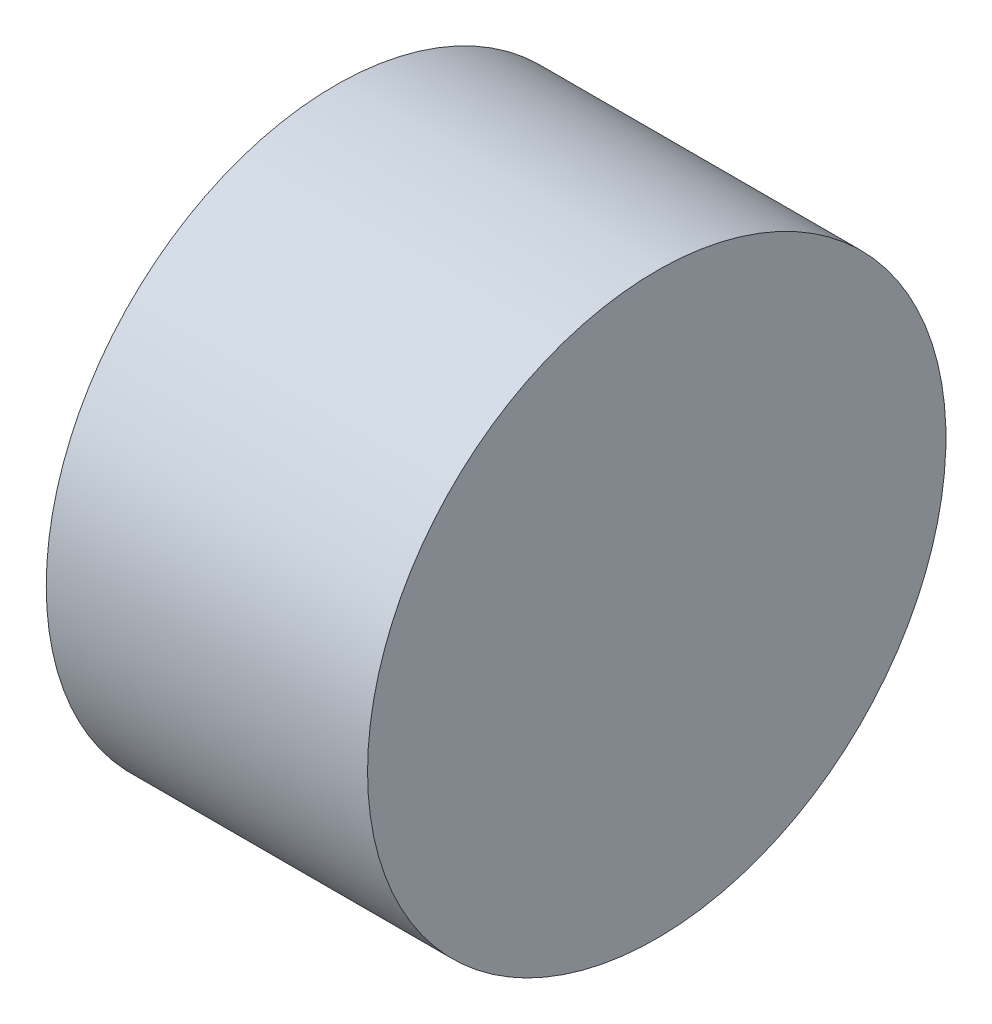
ISO-10303-21;
HEADER;
FILE_DESCRIPTION(('STEP AP214'),'2;1');
FILE_NAME('part.step','',(''),(''),'','','');
FILE_SCHEMA(('AUTOMOTIVE_DESIGN { 1 0 10303 214 1 1 1 1 }'));
ENDSEC;
DATA;
#1=APPLICATION_CONTEXT('core data for automotive mechanical design processes');
#2=APPLICATION_PROTOCOL_DEFINITION('international standard','automotive_design',2000,#1);
#3=PRODUCT_CONTEXT('',#1,'mechanical');
#4=PRODUCT('Part','Part','',(#3));
#5=PRODUCT_RELATED_PRODUCT_CATEGORY('part','',(#4));
#6=PRODUCT_DEFINITION_FORMATION('','',#4);
#7=PRODUCT_DEFINITION_CONTEXT('part definition',#1,'design');
#8=PRODUCT_DEFINITION('design','',#6,#7);
#9=PRODUCT_DEFINITION_SHAPE('','',#8);
#10=(LENGTH_UNIT() NAMED_UNIT(*) SI_UNIT(.MILLI.,.METRE.));
#11=(NAMED_UNIT(*) PLANE_ANGLE_UNIT() SI_UNIT($,.RADIAN.));
#12=(NAMED_UNIT(*) SI_UNIT($,.STERADIAN.) SOLID_ANGLE_UNIT());
#13=UNCERTAINTY_MEASURE_WITH_UNIT(LENGTH_MEASURE(1.E-05),#10,'distance_accuracy_value','');
#14=(GEOMETRIC_REPRESENTATION_CONTEXT(3) GLOBAL_UNCERTAINTY_ASSIGNED_CONTEXT((#13)) GLOBAL_UNIT_ASSIGNED_CONTEXT((#10,
#11,#12)) REPRESENTATION_CONTEXT('',''));
#15=CARTESIAN_POINT('',(0.,0.,0.));
#16=DIRECTION('',(0.,0.,1.));
#17=DIRECTION('',(1.,0.,0.));
#18=AXIS2_PLACEMENT_3D('',#15,#16,#17);
#19=CARTESIAN_POINT('',(-3.433333333333,-3.6,15.424059202831));
#20=DIRECTION('',(-1.,0.,0.));
#21=DIRECTION('',(0.,0.,1.));
#22=AXIS2_PLACEMENT_3D('',#19,#20,#21);
#23=PLANE('',#22);
#24=CARTESIAN_POINT('',(-3.433333333333,-3.6,15.424059202831));
#25=DIRECTION('',(-1.,0.,0.));
#26=DIRECTION('',(0.,0.,1.));
#27=AXIS2_PLACEMENT_3D('',#24,#25,#26);
#28=CIRCLE('',#27,0.3);
#29=CARTESIAN_POINT('',(-3.433333333333,-3.6,15.724059202831));
#30=VERTEX_POINT('',#29);
#31=EDGE_CURVE('E18',#30,#30,#28,.T.);
#32=ORIENTED_EDGE('',*,*,#31,.F.);
#33=EDGE_LOOP('',(#32));
#34=FACE_BOUND('',#33,.T.);
#35=ADVANCED_FACE('F15',(#34),#23,.F.);
#36=CARTESIAN_POINT('',(-3.766666666667,-3.6,15.424059202831));
#37=DIRECTION('',(-1.,0.,0.));
#38=DIRECTION('',(0.,0.,1.));
#39=AXIS2_PLACEMENT_3D('',#36,#37,#38);
#40=PLANE('',#39);
#41=CARTESIAN_POINT('',(-3.766666666667,-3.6,15.424059202831));
#42=DIRECTION('',(-1.,0.,0.));
#43=DIRECTION('',(0.,0.,1.));
#44=AXIS2_PLACEMENT_3D('',#41,#42,#43);
#45=CIRCLE('',#44,0.3);
#46=CARTESIAN_POINT('',(-3.766666666667,-3.6,15.724059202831));
#47=VERTEX_POINT('',#46);
#48=EDGE_CURVE('E10',#47,#47,#45,.F.);
#49=ORIENTED_EDGE('',*,*,#48,.F.);
#50=EDGE_LOOP('',(#49));
#51=FACE_BOUND('',#50,.T.);
#52=ADVANCED_FACE('F33',(#51),#40,.T.);
#53=CARTESIAN_POINT('',(-3.433333333333,-3.6,15.424059202831));
#54=DIRECTION('',(-1.,0.,0.));
#55=DIRECTION('',(0.,0.,1.));
#56=AXIS2_PLACEMENT_3D('',#53,#54,#55);
#57=CYLINDRICAL_SURFACE('',#56,0.3);
#58=ORIENTED_EDGE('',*,*,#31,.T.);
#59=EDGE_LOOP('',(#58));
#60=FACE_BOUND('',#59,.T.);
#61=ORIENTED_EDGE('',*,*,#48,.T.);
#62=EDGE_LOOP('',(#61));
#63=FACE_BOUND('',#62,.T.);
#64=ADVANCED_FACE('F30',(#60,#63),#57,.T.);
#65=CLOSED_SHELL('',(#35,#52,#64));
#66=MANIFOLD_SOLID_BREP('B1',#65);
#67=ADVANCED_BREP_SHAPE_REPRESENTATION('',(#18,#66),#14);
#68=SHAPE_DEFINITION_REPRESENTATION(#9,#67);
ENDSEC;
END-ISO-10303-21;
